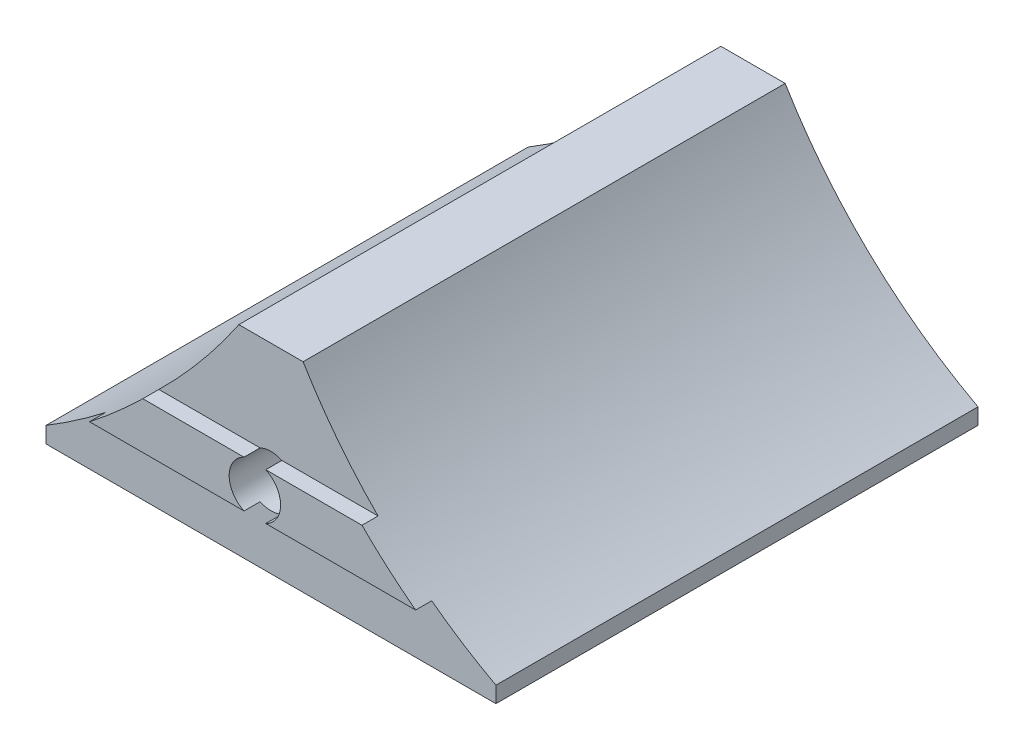
ISO-10303-21;
HEADER;
FILE_DESCRIPTION(('STEP AP214'),'2;1');
FILE_NAME('part.step','',(''),(''),'','','');
FILE_SCHEMA(('AUTOMOTIVE_DESIGN { 1 0 10303 214 1 1 1 1 }'));
ENDSEC;
DATA;
#1=APPLICATION_CONTEXT('core data for automotive mechanical design processes');
#2=APPLICATION_PROTOCOL_DEFINITION('international standard','automotive_design',2000,#1);
#3=PRODUCT_CONTEXT('',#1,'mechanical');
#4=PRODUCT('Part','Part','',(#3));
#5=PRODUCT_RELATED_PRODUCT_CATEGORY('part','',(#4));
#6=PRODUCT_DEFINITION_FORMATION('','',#4);
#7=PRODUCT_DEFINITION_CONTEXT('part definition',#1,'design');
#8=PRODUCT_DEFINITION('design','',#6,#7);
#9=PRODUCT_DEFINITION_SHAPE('','',#8);
#10=(LENGTH_UNIT() NAMED_UNIT(*) SI_UNIT(.MILLI.,.METRE.));
#11=(NAMED_UNIT(*) PLANE_ANGLE_UNIT() SI_UNIT($,.RADIAN.));
#12=(NAMED_UNIT(*) SI_UNIT($,.STERADIAN.) SOLID_ANGLE_UNIT());
#13=UNCERTAINTY_MEASURE_WITH_UNIT(LENGTH_MEASURE(1.E-05),#10,'distance_accuracy_value','');
#14=(GEOMETRIC_REPRESENTATION_CONTEXT(3) GLOBAL_UNCERTAINTY_ASSIGNED_CONTEXT((#13)) GLOBAL_UNIT_ASSIGNED_CONTEXT((#10,
#11,#12)) REPRESENTATION_CONTEXT('',''));
#15=CARTESIAN_POINT('',(0.,0.,0.));
#16=DIRECTION('',(0.,0.,1.));
#17=DIRECTION('',(1.,0.,0.));
#18=AXIS2_PLACEMENT_3D('',#15,#16,#17);
#19=CARTESIAN_POINT('',(18.0126781642585,13.0968447552989,0.));
#20=DIRECTION('',(0.,0.,1.));
#21=DIRECTION('',(1.,0.,0.));
#22=AXIS2_PLACEMENT_3D('',#19,#20,#21);
#23=CYLINDRICAL_SURFACE('',#22,1.6);
#24=CARTESIAN_POINT('',(18.0126781642585,13.0968447552989,30.));
#25=DIRECTION('',(0.,0.,1.));
#26=DIRECTION('',(1.,0.,0.));
#27=AXIS2_PLACEMENT_3D('',#24,#25,#26);
#28=CIRCLE('',#27,1.6);
#29=CARTESIAN_POINT('',(17.3362907013351,11.6468447552989,30.));
#30=VERTEX_POINT('',#29);
#31=CARTESIAN_POINT('',(18.689065627182,11.6468447552989,30.));
#32=VERTEX_POINT('',#31);
#33=EDGE_CURVE('E245',#30,#32,#28,.T.);
#34=ORIENTED_EDGE('',*,*,#33,.T.);
#35=DIRECTION('',(0.,0.,1.));
#36=VECTOR('',#35,1.);
#37=CARTESIAN_POINT('',(18.689065627182,11.6468447552989,0.));
#38=LINE('',#37,#36);
#39=CARTESIAN_POINT('',(18.689065627182,11.6468447552989,31.));
#40=VERTEX_POINT('',#39);
#41=EDGE_CURVE('E139',#40,#32,#38,.F.);
#42=ORIENTED_EDGE('',*,*,#41,.F.);
#43=CARTESIAN_POINT('',(18.0126781642585,13.0968447552989,31.));
#44=DIRECTION('',(0.,0.,-1.));
#45=DIRECTION('',(-1.,0.,0.));
#46=AXIS2_PLACEMENT_3D('',#43,#44,#45);
#47=CIRCLE('',#46,1.6);
#48=CARTESIAN_POINT('',(18.689065627182,14.5468447552989,31.));
#49=VERTEX_POINT('',#48);
#50=EDGE_CURVE('E11',#49,#40,#47,.T.);
#51=ORIENTED_EDGE('',*,*,#50,.F.);
#52=DIRECTION('',(0.,0.,1.));
#53=VECTOR('',#52,1.);
#54=CARTESIAN_POINT('',(18.689065627182,14.5468447552989,0.));
#55=LINE('',#54,#53);
#56=CARTESIAN_POINT('',(18.689065627182,14.5468447552989,30.));
#57=VERTEX_POINT('',#56);
#58=EDGE_CURVE('E136',#57,#49,#55,.T.);
#59=ORIENTED_EDGE('',*,*,#58,.F.);
#60=CARTESIAN_POINT('',(18.0126781642585,13.0968447552989,30.));
#61=DIRECTION('',(0.,0.,1.));
#62=DIRECTION('',(1.,0.,0.));
#63=AXIS2_PLACEMENT_3D('',#60,#61,#62);
#64=CIRCLE('',#63,1.6);
#65=CARTESIAN_POINT('',(17.3362907013351,14.5468447552989,30.));
#66=VERTEX_POINT('',#65);
#67=EDGE_CURVE('E150',#57,#66,#64,.T.);
#68=ORIENTED_EDGE('',*,*,#67,.T.);
#69=DIRECTION('',(0.,0.,1.));
#70=VECTOR('',#69,1.);
#71=CARTESIAN_POINT('',(17.3362907013351,14.5468447552989,0.));
#72=LINE('',#71,#70);
#73=CARTESIAN_POINT('',(17.3362907013351,14.5468447552989,31.));
#74=VERTEX_POINT('',#73);
#75=EDGE_CURVE('E50',#74,#66,#72,.F.);
#76=ORIENTED_EDGE('',*,*,#75,.F.);
#77=CARTESIAN_POINT('',(17.3362907013351,11.6468447552989,31.));
#78=VERTEX_POINT('',#77);
#79=EDGE_CURVE('E43',#78,#74,#47,.T.);
#80=ORIENTED_EDGE('',*,*,#79,.F.);
#81=DIRECTION('',(0.,0.,1.));
#82=VECTOR('',#81,1.);
#83=CARTESIAN_POINT('',(17.3362907013351,11.6468447552989,0.));
#84=LINE('',#83,#82);
#85=EDGE_CURVE('E243',#30,#78,#84,.T.);
#86=ORIENTED_EDGE('',*,*,#85,.F.);
#87=EDGE_LOOP('',(#34,#42,#51,#59,#68,#76,#80,#86));
#88=FACE_BOUND('',#87,.T.);
#89=CARTESIAN_POINT('',(18.0126781642585,13.0968447552989,10.));
#90=DIRECTION('',(0.,0.,-1.));
#91=DIRECTION('',(-1.,0.,0.));
#92=AXIS2_PLACEMENT_3D('',#89,#90,#91);
#93=CIRCLE('',#92,1.6);
#94=CARTESIAN_POINT('',(16.4126781642585,13.0968447552989,10.));
#95=VERTEX_POINT('',#94);
#96=EDGE_CURVE('E38',#95,#95,#93,.F.);
#97=ORIENTED_EDGE('',*,*,#96,.F.);
#98=EDGE_LOOP('',(#97));
#99=FACE_BOUND('',#98,.T.);
#100=ADVANCED_FACE('F34',(#88,#99),#23,.F.);
#101=CARTESIAN_POINT('',(7.718707450273,11.6468447552989,31.));
#102=DIRECTION('',(0.,1.,0.));
#103=DIRECTION('',(0.,0.,1.));
#104=AXIS2_PLACEMENT_3D('',#101,#102,#103);
#105=PLANE('',#104);
#106=DIRECTION('',(1.,0.,0.));
#107=VECTOR('',#106,1.);
#108=CARTESIAN_POINT('',(7.718707450273,11.6468447552989,30.));
#109=LINE('',#108,#107);
#110=CARTESIAN_POINT('',(7.718707450273,11.6468447552989,30.));
#111=VERTEX_POINT('',#110);
#112=EDGE_CURVE('E58',#111,#30,#109,.T.);
#113=ORIENTED_EDGE('',*,*,#112,.T.);
#114=ORIENTED_EDGE('',*,*,#85,.T.);
#115=DIRECTION('',(1.,0.,0.));
#116=VECTOR('',#115,1.);
#117=CARTESIAN_POINT('',(7.718707450273,11.6468447552989,31.));
#118=LINE('',#117,#116);
#119=CARTESIAN_POINT('',(7.718707450273,11.6468447552989,31.));
#120=VERTEX_POINT('',#119);
#121=EDGE_CURVE('E230',#120,#78,#118,.T.);
#122=ORIENTED_EDGE('',*,*,#121,.F.);
#123=DIRECTION('',(0.,0.,-1.));
#124=VECTOR('',#123,1.);
#125=CARTESIAN_POINT('',(7.718707450273,11.6468447552989,31.));
#126=LINE('',#125,#124);
#127=EDGE_CURVE('E174',#120,#111,#126,.T.);
#128=ORIENTED_EDGE('',*,*,#127,.T.);
#129=EDGE_LOOP('',(#113,#114,#122,#128));
#130=FACE_BOUND('',#129,.T.);
#131=ADVANCED_FACE('F262',(#130),#105,.F.);
#132=CARTESIAN_POINT('',(11.0359811988393,14.5468447552989,31.));
#133=DIRECTION('',(0.,-1.,0.));
#134=DIRECTION('',(0.,0.,-1.));
#135=AXIS2_PLACEMENT_3D('',#132,#133,#134);
#136=PLANE('',#135);
#137=DIRECTION('',(-1.,0.,0.));
#138=VECTOR('',#137,1.);
#139=CARTESIAN_POINT('',(11.0359811988393,14.5468447552989,30.));
#140=LINE('',#139,#138);
#141=CARTESIAN_POINT('',(24.6773857043777,14.5468447552989,30.));
#142=VERTEX_POINT('',#141);
#143=EDGE_CURVE('E149',#142,#57,#140,.T.);
#144=ORIENTED_EDGE('',*,*,#143,.T.);
#145=ORIENTED_EDGE('',*,*,#58,.T.);
#146=DIRECTION('',(-1.,0.,0.));
#147=VECTOR('',#146,1.);
#148=CARTESIAN_POINT('',(11.0359811988393,14.5468447552989,31.));
#149=LINE('',#148,#147);
#150=CARTESIAN_POINT('',(24.6773857043777,14.5468447552989,31.));
#151=VERTEX_POINT('',#150);
#152=EDGE_CURVE('E148',#151,#49,#149,.T.);
#153=ORIENTED_EDGE('',*,*,#152,.F.);
#154=DIRECTION('',(0.,0.,-1.));
#155=VECTOR('',#154,1.);
#156=CARTESIAN_POINT('',(24.6773857043777,14.5468447552989,31.));
#157=LINE('',#156,#155);
#158=EDGE_CURVE('E160',#151,#142,#157,.T.);
#159=ORIENTED_EDGE('',*,*,#158,.T.);
#160=EDGE_LOOP('',(#144,#145,#153,#159));
#161=FACE_BOUND('',#160,.T.);
#162=ADVANCED_FACE('F146',(#161),#136,.F.);
#163=CARTESIAN_POINT('',(-15.9206210697884,42.034871132815,31.));
#164=DIRECTION('',(0.,0.,-1.));
#165=DIRECTION('',(-1.,0.,0.));
#166=AXIS2_PLACEMENT_3D('',#163,#164,#165);
#167=PLANE('',#166);
#168=ORIENTED_EDGE('',*,*,#152,.T.);
#169=ORIENTED_EDGE('',*,*,#50,.T.);
#170=CARTESIAN_POINT('',(28.0158467818861,11.6468447552989,31.));
#171=VERTEX_POINT('',#170);
#172=EDGE_CURVE('E240',#40,#171,#118,.T.);
#173=ORIENTED_EDGE('',*,*,#172,.T.);
#174=CARTESIAN_POINT('',(46.7065120691158,36.5350239819105,31.));
#175=DIRECTION('',(0.,0.,-1.));
#176=DIRECTION('',(1.,0.,0.));
#177=AXIS2_PLACEMENT_3D('',#174,#175,#176);
#178=CIRCLE('',#177,31.1249487404429);
#179=EDGE_CURVE('E154',#171,#151,#178,.T.);
#180=ORIENTED_EDGE('',*,*,#179,.T.);
#181=EDGE_LOOP('',(#168,#169,#173,#180));
#182=FACE_BOUND('',#181,.T.);
#183=ADVANCED_FACE('F152',(#182),#167,.F.);
#184=CARTESIAN_POINT('',(-15.9206210697884,42.034871132815,30.));
#185=DIRECTION('',(0.,0.,1.));
#186=DIRECTION('',(1.,0.,0.));
#187=AXIS2_PLACEMENT_3D('',#184,#185,#186);
#188=PLANE('',#187);
#189=ORIENTED_EDGE('',*,*,#67,.F.);
#190=ORIENTED_EDGE('',*,*,#143,.F.);
#191=CARTESIAN_POINT('',(46.7065120691158,36.5350239819105,30.));
#192=DIRECTION('',(0.,0.,-1.));
#193=DIRECTION('',(1.,0.,0.));
#194=AXIS2_PLACEMENT_3D('',#191,#192,#193);
#195=CIRCLE('',#194,31.1249487404429);
#196=CARTESIAN_POINT('',(20.0126781642585,20.5287231739447,30.));
#197=VERTEX_POINT('',#196);
#198=EDGE_CURVE('E184',#142,#197,#195,.T.);
#199=ORIENTED_EDGE('',*,*,#198,.T.);
#200=DIRECTION('',(-1.,0.,0.));
#201=VECTOR('',#200,1.);
#202=CARTESIAN_POINT('',(16.0126781642585,20.5287231739447,30.));
#203=LINE('',#202,#201);
#204=CARTESIAN_POINT('',(16.0126781642585,20.5287231739447,30.));
#205=VERTEX_POINT('',#204);
#206=EDGE_CURVE('E188',#197,#205,#203,.T.);
#207=ORIENTED_EDGE('',*,*,#206,.T.);
#208=CARTESIAN_POINT('',(-15.9206210697884,42.034871132815,30.));
#209=DIRECTION('',(0.,0.,-1.));
#210=DIRECTION('',(1.,0.,0.));
#211=AXIS2_PLACEMENT_3D('',#208,#209,#210);
#212=CIRCLE('',#211,38.5);
#213=CARTESIAN_POINT('',(11.0359811988393,14.5468447552989,30.));
#214=VERTEX_POINT('',#213);
#215=EDGE_CURVE('E191',#205,#214,#212,.T.);
#216=ORIENTED_EDGE('',*,*,#215,.T.);
#217=EDGE_CURVE('E166',#66,#214,#140,.T.);
#218=ORIENTED_EDGE('',*,*,#217,.F.);
#219=EDGE_LOOP('',(#189,#190,#199,#207,#216,#218));
#220=FACE_BOUND('',#219,.T.);
#221=ADVANCED_FACE('F285',(#220),#188,.T.);
#222=CARTESIAN_POINT('',(32.0126781642585,8.09684475529889,30.));
#223=DIRECTION('',(0.,1.,0.));
#224=DIRECTION('',(0.,0.,1.));
#225=AXIS2_PLACEMENT_3D('',#222,#223,#224);
#226=PLANE('',#225);
#227=DIRECTION('',(1.,0.,0.));
#228=VECTOR('',#227,1.);
#229=CARTESIAN_POINT('',(32.0126781642585,8.09684475529889,0.));
#230=LINE('',#229,#228);
#231=CARTESIAN_POINT('',(4.01267816425853,8.09684475529889,0.));
#232=VERTEX_POINT('',#231);
#233=CARTESIAN_POINT('',(32.0126781642585,8.09684475529889,0.));
#234=VERTEX_POINT('',#233);
#235=EDGE_CURVE('E177',#232,#234,#230,.T.);
#236=ORIENTED_EDGE('',*,*,#235,.T.);
#237=DIRECTION('',(0.,0.,-1.));
#238=VECTOR('',#237,1.);
#239=CARTESIAN_POINT('',(32.0126781642585,8.09684475529889,30.));
#240=LINE('',#239,#238);
#241=CARTESIAN_POINT('',(32.0126781642585,8.09684475529889,30.));
#242=VERTEX_POINT('',#241);
#243=EDGE_CURVE('E222',#242,#234,#240,.T.);
#244=ORIENTED_EDGE('',*,*,#243,.F.);
#245=DIRECTION('',(1.,0.,0.));
#246=VECTOR('',#245,1.);
#247=CARTESIAN_POINT('',(32.0126781642585,8.09684475529889,30.));
#248=LINE('',#247,#246);
#249=CARTESIAN_POINT('',(4.01267816425853,8.09684475529889,30.));
#250=VERTEX_POINT('',#249);
#251=EDGE_CURVE('E178',#250,#242,#248,.T.);
#252=ORIENTED_EDGE('',*,*,#251,.F.);
#253=DIRECTION('',(0.,0.,-1.));
#254=VECTOR('',#253,1.);
#255=CARTESIAN_POINT('',(4.01267816425853,8.09684475529889,30.));
#256=LINE('',#255,#254);
#257=EDGE_CURVE('E196',#250,#232,#256,.T.);
#258=ORIENTED_EDGE('',*,*,#257,.T.);
#259=EDGE_LOOP('',(#236,#244,#252,#258));
#260=FACE_BOUND('',#259,.T.);
#261=ADVANCED_FACE('F36',(#260),#226,.F.);
#262=CARTESIAN_POINT('',(32.0126781642585,9.09684475529889,30.));
#263=DIRECTION('',(-1.,0.,0.));
#264=DIRECTION('',(0.,0.,1.));
#265=AXIS2_PLACEMENT_3D('',#262,#263,#264);
#266=PLANE('',#265);
#267=DIRECTION('',(0.,1.,0.));
#268=VECTOR('',#267,1.);
#269=CARTESIAN_POINT('',(32.0126781642585,9.09684475529889,0.));
#270=LINE('',#269,#268);
#271=CARTESIAN_POINT('',(32.0126781642585,9.0968447552989,0.));
#272=VERTEX_POINT('',#271);
#273=EDGE_CURVE('E199',#234,#272,#270,.T.);
#274=ORIENTED_EDGE('',*,*,#273,.T.);
#275=DIRECTION('',(0.,0.,-1.));
#276=VECTOR('',#275,1.);
#277=CARTESIAN_POINT('',(32.0126781642585,9.0968447552989,30.));
#278=LINE('',#277,#276);
#279=CARTESIAN_POINT('',(32.0126781642585,9.0968447552989,30.));
#280=VERTEX_POINT('',#279);
#281=EDGE_CURVE('E219',#280,#272,#278,.T.);
#282=ORIENTED_EDGE('',*,*,#281,.F.);
#283=DIRECTION('',(0.,1.,0.));
#284=VECTOR('',#283,1.);
#285=CARTESIAN_POINT('',(32.0126781642585,9.09684475529889,30.));
#286=LINE('',#285,#284);
#287=EDGE_CURVE('E181',#242,#280,#286,.T.);
#288=ORIENTED_EDGE('',*,*,#287,.F.);
#289=ORIENTED_EDGE('',*,*,#243,.T.);
#290=EDGE_LOOP('',(#274,#282,#288,#289));
#291=FACE_BOUND('',#290,.T.);
#292=ADVANCED_FACE('F300',(#291),#266,.F.);
#293=CARTESIAN_POINT('',(46.7065120691158,36.5350239819105,30.));
#294=DIRECTION('',(0.,0.,-1.));
#295=DIRECTION('',(-1.,0.,0.));
#296=AXIS2_PLACEMENT_3D('',#293,#294,#295);
#297=CYLINDRICAL_SURFACE('',#296,31.1249487404429);
#298=CARTESIAN_POINT('',(46.7065120691158,36.5350239819105,0.));
#299=DIRECTION('',(0.,0.,-1.));
#300=DIRECTION('',(1.,0.,0.));
#301=AXIS2_PLACEMENT_3D('',#298,#299,#300);
#302=CIRCLE('',#301,31.1249487404429);
#303=CARTESIAN_POINT('',(20.0126781642585,20.5287231739447,0.));
#304=VERTEX_POINT('',#303);
#305=EDGE_CURVE('E201',#272,#304,#302,.T.);
#306=ORIENTED_EDGE('',*,*,#305,.T.);
#307=DIRECTION('',(0.,0.,-1.));
#308=VECTOR('',#307,1.);
#309=CARTESIAN_POINT('',(20.0126781642585,20.5287231739447,30.));
#310=LINE('',#309,#308);
#311=EDGE_CURVE('E216',#197,#304,#310,.T.);
#312=ORIENTED_EDGE('',*,*,#311,.F.);
#313=ORIENTED_EDGE('',*,*,#198,.F.);
#314=ORIENTED_EDGE('',*,*,#158,.F.);
#315=ORIENTED_EDGE('',*,*,#179,.F.);
#316=DIRECTION('',(0.,0.,-1.));
#317=VECTOR('',#316,1.);
#318=CARTESIAN_POINT('',(28.0158467818861,11.6468447552989,31.));
#319=LINE('',#318,#317);
#320=CARTESIAN_POINT('',(28.0158467818861,11.6468447552989,30.));
#321=VERTEX_POINT('',#320);
#322=EDGE_CURVE('E171',#171,#321,#319,.T.);
#323=ORIENTED_EDGE('',*,*,#322,.T.);
#324=EDGE_CURVE('E185',#280,#321,#195,.T.);
#325=ORIENTED_EDGE('',*,*,#324,.F.);
#326=ORIENTED_EDGE('',*,*,#281,.T.);
#327=EDGE_LOOP('',(#306,#312,#313,#314,#315,#323,#325,#326));
#328=FACE_BOUND('',#327,.T.);
#329=ADVANCED_FACE('F297',(#328),#297,.F.);
#330=CARTESIAN_POINT('',(16.0126781642585,20.5287231739447,30.));
#331=DIRECTION('',(0.,-1.,0.));
#332=DIRECTION('',(0.,0.,-1.));
#333=AXIS2_PLACEMENT_3D('',#330,#331,#332);
#334=PLANE('',#333);
#335=DIRECTION('',(-1.,0.,0.));
#336=VECTOR('',#335,1.);
#337=CARTESIAN_POINT('',(16.0126781642585,20.5287231739447,0.));
#338=LINE('',#337,#336);
#339=CARTESIAN_POINT('',(16.0126781642585,20.5287231739447,0.));
#340=VERTEX_POINT('',#339);
#341=EDGE_CURVE('E203',#304,#340,#338,.T.);
#342=ORIENTED_EDGE('',*,*,#341,.T.);
#343=DIRECTION('',(0.,0.,-1.));
#344=VECTOR('',#343,1.);
#345=CARTESIAN_POINT('',(16.0126781642585,20.5287231739447,30.));
#346=LINE('',#345,#344);
#347=EDGE_CURVE('E213',#205,#340,#346,.T.);
#348=ORIENTED_EDGE('',*,*,#347,.F.);
#349=ORIENTED_EDGE('',*,*,#206,.F.);
#350=ORIENTED_EDGE('',*,*,#311,.T.);
#351=EDGE_LOOP('',(#342,#348,#349,#350));
#352=FACE_BOUND('',#351,.T.);
#353=ADVANCED_FACE('F294',(#352),#334,.F.);
#354=CARTESIAN_POINT('',(-15.9206210697884,42.034871132815,30.));
#355=DIRECTION('',(0.,0.,-1.));
#356=DIRECTION('',(-1.,0.,0.));
#357=AXIS2_PLACEMENT_3D('',#354,#355,#356);
#358=CYLINDRICAL_SURFACE('',#357,38.5);
#359=CARTESIAN_POINT('',(-15.9206210697884,42.034871132815,0.));
#360=DIRECTION('',(0.,0.,-1.));
#361=DIRECTION('',(1.,0.,0.));
#362=AXIS2_PLACEMENT_3D('',#359,#360,#361);
#363=CIRCLE('',#362,38.5);
#364=CARTESIAN_POINT('',(4.01267816425853,9.09684475529889,0.));
#365=VERTEX_POINT('',#364);
#366=EDGE_CURVE('E205',#340,#365,#363,.T.);
#367=ORIENTED_EDGE('',*,*,#366,.T.);
#368=DIRECTION('',(0.,0.,-1.));
#369=VECTOR('',#368,1.);
#370=CARTESIAN_POINT('',(4.01267816425853,9.09684475529889,30.));
#371=LINE('',#370,#369);
#372=CARTESIAN_POINT('',(4.01267816425853,9.09684475529889,30.));
#373=VERTEX_POINT('',#372);
#374=EDGE_CURVE('E210',#373,#365,#371,.T.);
#375=ORIENTED_EDGE('',*,*,#374,.F.);
#376=EDGE_CURVE('E190',#111,#373,#212,.T.);
#377=ORIENTED_EDGE('',*,*,#376,.F.);
#378=ORIENTED_EDGE('',*,*,#127,.F.);
#379=CARTESIAN_POINT('',(-15.9206210697884,42.034871132815,31.));
#380=DIRECTION('',(0.,0.,-1.));
#381=DIRECTION('',(-1.,0.,0.));
#382=AXIS2_PLACEMENT_3D('',#379,#380,#381);
#383=CIRCLE('',#382,38.5);
#384=CARTESIAN_POINT('',(11.0359811988393,14.5468447552989,31.));
#385=VERTEX_POINT('',#384);
#386=EDGE_CURVE('E168',#385,#120,#383,.T.);
#387=ORIENTED_EDGE('',*,*,#386,.F.);
#388=DIRECTION('',(0.,0.,-1.));
#389=VECTOR('',#388,1.);
#390=CARTESIAN_POINT('',(11.0359811988393,14.5468447552989,31.));
#391=LINE('',#390,#389);
#392=EDGE_CURVE('E156',#385,#214,#391,.T.);
#393=ORIENTED_EDGE('',*,*,#392,.T.);
#394=ORIENTED_EDGE('',*,*,#215,.F.);
#395=ORIENTED_EDGE('',*,*,#347,.T.);
#396=EDGE_LOOP('',(#367,#375,#377,#378,#387,#393,#394,#395));
#397=FACE_BOUND('',#396,.T.);
#398=ADVANCED_FACE('F239',(#397),#358,.F.);
#399=CARTESIAN_POINT('',(4.01267816425853,8.09684475529889,30.));
#400=DIRECTION('',(1.,0.,0.));
#401=DIRECTION('',(0.,0.,-1.));
#402=AXIS2_PLACEMENT_3D('',#399,#400,#401);
#403=PLANE('',#402);
#404=DIRECTION('',(0.,-1.,0.));
#405=VECTOR('',#404,1.);
#406=CARTESIAN_POINT('',(4.01267816425853,8.09684475529889,0.));
#407=LINE('',#406,#405);
#408=EDGE_CURVE('E182',#365,#232,#407,.T.);
#409=ORIENTED_EDGE('',*,*,#408,.T.);
#410=ORIENTED_EDGE('',*,*,#257,.F.);
#411=DIRECTION('',(0.,-1.,0.));
#412=VECTOR('',#411,1.);
#413=CARTESIAN_POINT('',(4.01267816425853,8.09684475529889,30.));
#414=LINE('',#413,#412);
#415=EDGE_CURVE('E194',#373,#250,#414,.T.);
#416=ORIENTED_EDGE('',*,*,#415,.F.);
#417=ORIENTED_EDGE('',*,*,#374,.T.);
#418=EDGE_LOOP('',(#409,#410,#416,#417));
#419=FACE_BOUND('',#418,.T.);
#420=ADVANCED_FACE('F284',(#419),#403,.F.);
#421=ORIENTED_EDGE('',*,*,#33,.F.);
#422=ORIENTED_EDGE('',*,*,#112,.F.);
#423=ORIENTED_EDGE('',*,*,#376,.T.);
#424=ORIENTED_EDGE('',*,*,#415,.T.);
#425=ORIENTED_EDGE('',*,*,#251,.T.);
#426=ORIENTED_EDGE('',*,*,#287,.T.);
#427=ORIENTED_EDGE('',*,*,#324,.T.);
#428=EDGE_CURVE('E167',#32,#321,#109,.T.);
#429=ORIENTED_EDGE('',*,*,#428,.F.);
#430=EDGE_LOOP('',(#421,#422,#423,#424,#425,#426,#427,#429));
#431=FACE_BOUND('',#430,.T.);
#432=ADVANCED_FACE('F281',(#431),#188,.T.);
#433=CARTESIAN_POINT('',(-15.9206210697884,42.034871132815,0.));
#434=DIRECTION('',(0.,0.,1.));
#435=DIRECTION('',(1.,0.,0.));
#436=AXIS2_PLACEMENT_3D('',#433,#434,#435);
#437=PLANE('',#436);
#438=CARTESIAN_POINT('',(18.0126781642585,13.0968447552989,0.));
#439=DIRECTION('',(0.,0.,-1.));
#440=DIRECTION('',(-1.,0.,0.));
#441=AXIS2_PLACEMENT_3D('',#438,#439,#440);
#442=CIRCLE('',#441,4.25);
#443=CARTESIAN_POINT('',(13.7626781642585,13.0968447552989,0.));
#444=VERTEX_POINT('',#443);
#445=EDGE_CURVE('E250',#444,#444,#442,.T.);
#446=ORIENTED_EDGE('',*,*,#445,.F.);
#447=EDGE_LOOP('',(#446));
#448=FACE_BOUND('',#447,.T.);
#449=ORIENTED_EDGE('',*,*,#235,.F.);
#450=ORIENTED_EDGE('',*,*,#408,.F.);
#451=ORIENTED_EDGE('',*,*,#366,.F.);
#452=ORIENTED_EDGE('',*,*,#341,.F.);
#453=ORIENTED_EDGE('',*,*,#305,.F.);
#454=ORIENTED_EDGE('',*,*,#273,.F.);
#455=EDGE_LOOP('',(#449,#450,#451,#452,#453,#454));
#456=FACE_BOUND('',#455,.T.);
#457=ADVANCED_FACE('F279',(#448,#456),#437,.F.);
#458=ORIENTED_EDGE('',*,*,#172,.F.);
#459=ORIENTED_EDGE('',*,*,#41,.T.);
#460=ORIENTED_EDGE('',*,*,#428,.T.);
#461=ORIENTED_EDGE('',*,*,#322,.F.);
#462=EDGE_LOOP('',(#458,#459,#460,#461));
#463=FACE_BOUND('',#462,.T.);
#464=ADVANCED_FACE('F269',(#463),#105,.F.);
#465=EDGE_CURVE('E157',#74,#385,#149,.T.);
#466=ORIENTED_EDGE('',*,*,#465,.F.);
#467=ORIENTED_EDGE('',*,*,#75,.T.);
#468=ORIENTED_EDGE('',*,*,#217,.T.);
#469=ORIENTED_EDGE('',*,*,#392,.F.);
#470=EDGE_LOOP('',(#466,#467,#468,#469));
#471=FACE_BOUND('',#470,.T.);
#472=ADVANCED_FACE('F233',(#471),#136,.F.);
#473=ORIENTED_EDGE('',*,*,#121,.T.);
#474=ORIENTED_EDGE('',*,*,#79,.T.);
#475=ORIENTED_EDGE('',*,*,#465,.T.);
#476=ORIENTED_EDGE('',*,*,#386,.T.);
#477=EDGE_LOOP('',(#473,#474,#475,#476));
#478=FACE_BOUND('',#477,.T.);
#479=ADVANCED_FACE('F227',(#478),#167,.F.);
#480=CARTESIAN_POINT('',(18.0126781642585,13.0968447552989,10.));
#481=DIRECTION('',(0.,0.,-1.));
#482=DIRECTION('',(-1.,0.,0.));
#483=AXIS2_PLACEMENT_3D('',#480,#481,#482);
#484=PLANE('',#483);
#485=CARTESIAN_POINT('',(18.0126781642585,13.0968447552989,10.));
#486=DIRECTION('',(0.,0.,-1.));
#487=DIRECTION('',(-1.,0.,0.));
#488=AXIS2_PLACEMENT_3D('',#485,#486,#487);
#489=CIRCLE('',#488,4.25);
#490=CARTESIAN_POINT('',(13.7626781642585,13.0968447552989,10.));
#491=VERTEX_POINT('',#490);
#492=EDGE_CURVE('E253',#491,#491,#489,.T.);
#493=ORIENTED_EDGE('',*,*,#492,.T.);
#494=EDGE_LOOP('',(#493));
#495=FACE_BOUND('',#494,.T.);
#496=ORIENTED_EDGE('',*,*,#96,.T.);
#497=EDGE_LOOP('',(#496));
#498=FACE_BOUND('',#497,.T.);
#499=ADVANCED_FACE('F260',(#495,#498),#484,.T.);
#500=CARTESIAN_POINT('',(18.0126781642585,13.0968447552989,10.));
#501=DIRECTION('',(0.,0.,-1.));
#502=DIRECTION('',(-1.,0.,0.));
#503=AXIS2_PLACEMENT_3D('',#500,#501,#502);
#504=CYLINDRICAL_SURFACE('',#503,4.25);
#505=ORIENTED_EDGE('',*,*,#492,.F.);
#506=EDGE_LOOP('',(#505));
#507=FACE_BOUND('',#506,.T.);
#508=ORIENTED_EDGE('',*,*,#445,.T.);
#509=EDGE_LOOP('',(#508));
#510=FACE_BOUND('',#509,.T.);
#511=ADVANCED_FACE('F272',(#507,#510),#504,.F.);
#512=CLOSED_SHELL('',(#100,#131,#162,#183,#221,#261,#292,#329,#353,#398,#420,#432,#457,#464,
#472,#479,#499,#511));
#513=MANIFOLD_SOLID_BREP('B2',#512);
#514=ADVANCED_BREP_SHAPE_REPRESENTATION('',(#18,#513),#14);
#515=SHAPE_DEFINITION_REPRESENTATION(#9,#514);
ENDSEC;
END-ISO-10303-21;
